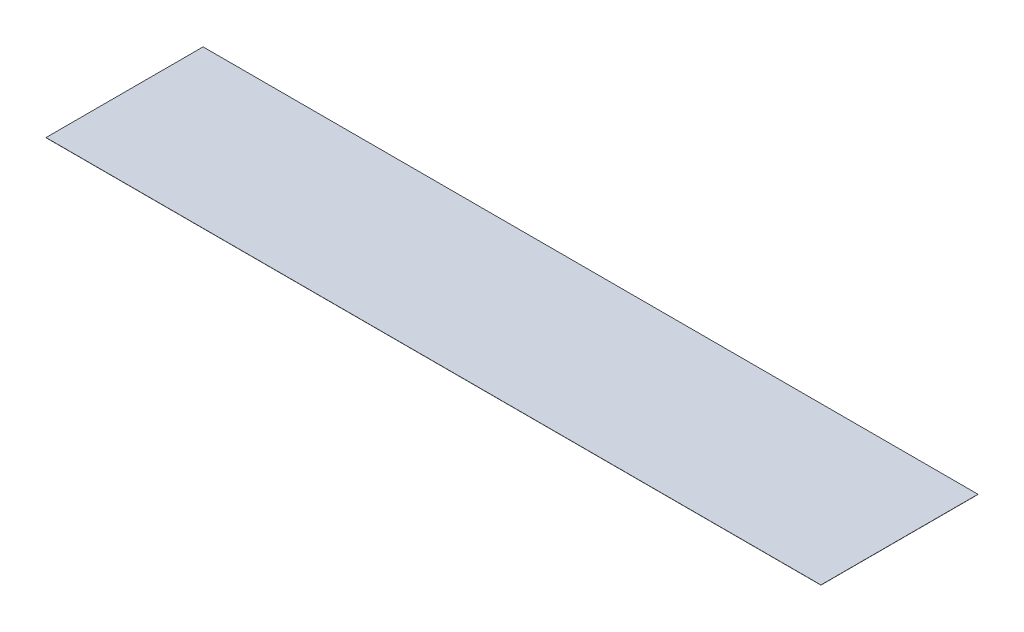
ISO-10303-21;
HEADER;
FILE_DESCRIPTION(('STEP AP214'),'2;1');
FILE_NAME('part.step','',(''),(''),'','','');
FILE_SCHEMA(('AUTOMOTIVE_DESIGN { 1 0 10303 214 1 1 1 1 }'));
ENDSEC;
DATA;
#1=APPLICATION_CONTEXT('core data for automotive mechanical design processes');
#2=APPLICATION_PROTOCOL_DEFINITION('international standard','automotive_design',2000,#1);
#3=PRODUCT_CONTEXT('',#1,'mechanical');
#4=PRODUCT('Part','Part','',(#3));
#5=PRODUCT_RELATED_PRODUCT_CATEGORY('part','',(#4));
#6=PRODUCT_DEFINITION_FORMATION('','',#4);
#7=PRODUCT_DEFINITION_CONTEXT('part definition',#1,'design');
#8=PRODUCT_DEFINITION('design','',#6,#7);
#9=PRODUCT_DEFINITION_SHAPE('','',#8);
#10=(LENGTH_UNIT() NAMED_UNIT(*) SI_UNIT(.MILLI.,.METRE.));
#11=(NAMED_UNIT(*) PLANE_ANGLE_UNIT() SI_UNIT($,.RADIAN.));
#12=(NAMED_UNIT(*) SI_UNIT($,.STERADIAN.) SOLID_ANGLE_UNIT());
#13=UNCERTAINTY_MEASURE_WITH_UNIT(LENGTH_MEASURE(1.E-05),#10,'distance_accuracy_value','');
#14=(GEOMETRIC_REPRESENTATION_CONTEXT(3) GLOBAL_UNCERTAINTY_ASSIGNED_CONTEXT((#13)) GLOBAL_UNIT_ASSIGNED_CONTEXT((#10,
#11,#12)) REPRESENTATION_CONTEXT('',''));
#15=CARTESIAN_POINT('',(0.,0.,0.));
#16=DIRECTION('',(0.,0.,1.));
#17=DIRECTION('',(1.,0.,0.));
#18=AXIS2_PLACEMENT_3D('',#15,#16,#17);
#19=CARTESIAN_POINT('',(0.,4.7752,0.));
#20=DIRECTION('',(1.,0.,0.));
#21=DIRECTION('',(0.,0.,-1.));
#22=AXIS2_PLACEMENT_3D('',#19,#20,#21);
#23=PLANE('',#22);
#24=DIRECTION('',(0.,0.,1.));
#25=VECTOR('',#24,1.);
#26=CARTESIAN_POINT('',(0.,0.,0.));
#27=LINE('',#26,#25);
#28=CARTESIAN_POINT('',(0.,-2.03000116716368E-12,-4572.));
#29=VERTEX_POINT('',#28);
#30=CARTESIAN_POINT('',(0.,0.,0.));
#31=VERTEX_POINT('',#30);
#32=EDGE_CURVE('E93',#29,#31,#27,.T.);
#33=ORIENTED_EDGE('',*,*,#32,.T.);
#34=DIRECTION('',(0.,-1.,0.));
#35=VECTOR('',#34,1.);
#36=CARTESIAN_POINT('',(0.,4.7752,0.));
#37=LINE('',#36,#35);
#38=CARTESIAN_POINT('',(0.,4.7752,0.));
#39=VERTEX_POINT('',#38);
#40=EDGE_CURVE('E11',#39,#31,#37,.T.);
#41=ORIENTED_EDGE('',*,*,#40,.F.);
#42=DIRECTION('',(0.,0.,1.));
#43=VECTOR('',#42,1.);
#44=CARTESIAN_POINT('',(0.,4.7752,0.));
#45=LINE('',#44,#43);
#46=CARTESIAN_POINT('',(0.,4.77519999999797,-4572.));
#47=VERTEX_POINT('',#46);
#48=EDGE_CURVE('E81',#47,#39,#45,.T.);
#49=ORIENTED_EDGE('',*,*,#48,.F.);
#50=DIRECTION('',(0.,-1.,0.));
#51=VECTOR('',#50,1.);
#52=CARTESIAN_POINT('',(0.,4.77519999999797,-4572.));
#53=LINE('',#52,#51);
#54=EDGE_CURVE('E89',#47,#29,#53,.T.);
#55=ORIENTED_EDGE('',*,*,#54,.T.);
#56=EDGE_LOOP('',(#33,#41,#49,#55));
#57=FACE_BOUND('',#56,.T.);
#58=ADVANCED_FACE('F30',(#57),#23,.F.);
#59=CARTESIAN_POINT('',(0.,4.7752,0.));
#60=DIRECTION('',(0.,0.,-1.));
#61=DIRECTION('',(-1.,0.,0.));
#62=AXIS2_PLACEMENT_3D('',#59,#60,#61);
#63=PLANE('',#62);
#64=DIRECTION('',(1.,0.,0.));
#65=VECTOR('',#64,1.);
#66=CARTESIAN_POINT('',(0.,0.,0.));
#67=LINE('',#66,#65);
#68=CARTESIAN_POINT('',(22555.2,0.,0.));
#69=VERTEX_POINT('',#68);
#70=EDGE_CURVE('E85',#31,#69,#67,.T.);
#71=ORIENTED_EDGE('',*,*,#70,.T.);
#72=DIRECTION('',(0.,-1.,0.));
#73=VECTOR('',#72,1.);
#74=CARTESIAN_POINT('',(22555.2,4.7752,0.));
#75=LINE('',#74,#73);
#76=CARTESIAN_POINT('',(22555.2,4.7752,0.));
#77=VERTEX_POINT('',#76);
#78=EDGE_CURVE('E38',#77,#69,#75,.T.);
#79=ORIENTED_EDGE('',*,*,#78,.F.);
#80=DIRECTION('',(1.,0.,0.));
#81=VECTOR('',#80,1.);
#82=CARTESIAN_POINT('',(0.,4.7752,0.));
#83=LINE('',#82,#81);
#84=EDGE_CURVE('E76',#39,#77,#83,.T.);
#85=ORIENTED_EDGE('',*,*,#84,.F.);
#86=ORIENTED_EDGE('',*,*,#40,.T.);
#87=EDGE_LOOP('',(#71,#79,#85,#86));
#88=FACE_BOUND('',#87,.T.);
#89=ADVANCED_FACE('F84',(#88),#63,.F.);
#90=CARTESIAN_POINT('',(22555.2,4.7752,0.));
#91=DIRECTION('',(-1.,0.,0.));
#92=DIRECTION('',(0.,0.,1.));
#93=AXIS2_PLACEMENT_3D('',#90,#91,#92);
#94=PLANE('',#93);
#95=DIRECTION('',(0.,0.,-1.));
#96=VECTOR('',#95,1.);
#97=CARTESIAN_POINT('',(22555.2,0.,0.));
#98=LINE('',#97,#96);
#99=CARTESIAN_POINT('',(22555.2,-2.03000116716368E-12,-4572.));
#100=VERTEX_POINT('',#99);
#101=EDGE_CURVE('E63',#69,#100,#98,.T.);
#102=ORIENTED_EDGE('',*,*,#101,.T.);
#103=DIRECTION('',(0.,-1.,0.));
#104=VECTOR('',#103,1.);
#105=CARTESIAN_POINT('',(22555.2,4.77519999999797,-4572.));
#106=LINE('',#105,#104);
#107=CARTESIAN_POINT('',(22555.2,4.77519999999797,-4572.));
#108=VERTEX_POINT('',#107);
#109=EDGE_CURVE('E86',#108,#100,#106,.T.);
#110=ORIENTED_EDGE('',*,*,#109,.F.);
#111=DIRECTION('',(0.,0.,-1.));
#112=VECTOR('',#111,1.);
#113=CARTESIAN_POINT('',(22555.2,4.7752,0.));
#114=LINE('',#113,#112);
#115=EDGE_CURVE('E79',#77,#108,#114,.T.);
#116=ORIENTED_EDGE('',*,*,#115,.F.);
#117=ORIENTED_EDGE('',*,*,#78,.T.);
#118=EDGE_LOOP('',(#102,#110,#116,#117));
#119=FACE_BOUND('',#118,.T.);
#120=ADVANCED_FACE('F87',(#119),#94,.F.);
#121=CARTESIAN_POINT('',(0.,4.77519999999797,-4572.));
#122=DIRECTION('',(0.,0.,1.));
#123=DIRECTION('',(1.,0.,0.));
#124=AXIS2_PLACEMENT_3D('',#121,#122,#123);
#125=PLANE('',#124);
#126=DIRECTION('',(-1.,0.,0.));
#127=VECTOR('',#126,1.);
#128=CARTESIAN_POINT('',(0.,-2.03000116716368E-12,-4572.));
#129=LINE('',#128,#127);
#130=EDGE_CURVE('E69',#100,#29,#129,.T.);
#131=ORIENTED_EDGE('',*,*,#130,.T.);
#132=ORIENTED_EDGE('',*,*,#54,.F.);
#133=DIRECTION('',(-1.,0.,0.));
#134=VECTOR('',#133,1.);
#135=CARTESIAN_POINT('',(0.,4.77519999999797,-4572.));
#136=LINE('',#135,#134);
#137=EDGE_CURVE('E46',#108,#47,#136,.T.);
#138=ORIENTED_EDGE('',*,*,#137,.F.);
#139=ORIENTED_EDGE('',*,*,#109,.T.);
#140=EDGE_LOOP('',(#131,#132,#138,#139));
#141=FACE_BOUND('',#140,.T.);
#142=ADVANCED_FACE('F100',(#141),#125,.F.);
#143=CARTESIAN_POINT('',(0.,4.7752,0.));
#144=DIRECTION('',(0.,-1.,0.));
#145=DIRECTION('',(0.,0.,-1.));
#146=AXIS2_PLACEMENT_3D('',#143,#144,#145);
#147=PLANE('',#146);
#148=ORIENTED_EDGE('',*,*,#48,.T.);
#149=ORIENTED_EDGE('',*,*,#84,.T.);
#150=ORIENTED_EDGE('',*,*,#115,.T.);
#151=ORIENTED_EDGE('',*,*,#137,.T.);
#152=EDGE_LOOP('',(#148,#149,#150,#151));
#153=FACE_BOUND('',#152,.T.);
#154=ADVANCED_FACE('F77',(#153),#147,.F.);
#155=CARTESIAN_POINT('',(0.,0.,0.));
#156=DIRECTION('',(0.,-1.,0.));
#157=DIRECTION('',(0.,0.,-1.));
#158=AXIS2_PLACEMENT_3D('',#155,#156,#157);
#159=PLANE('',#158);
#160=ORIENTED_EDGE('',*,*,#32,.F.);
#161=ORIENTED_EDGE('',*,*,#130,.F.);
#162=ORIENTED_EDGE('',*,*,#101,.F.);
#163=ORIENTED_EDGE('',*,*,#70,.F.);
#164=EDGE_LOOP('',(#160,#161,#162,#163));
#165=FACE_BOUND('',#164,.T.);
#166=ADVANCED_FACE('F103',(#165),#159,.T.);
#167=CLOSED_SHELL('',(#58,#89,#120,#142,#154,#166));
#168=MANIFOLD_SOLID_BREP('B2',#167);
#169=ADVANCED_BREP_SHAPE_REPRESENTATION('',(#18,#168),#14);
#170=SHAPE_DEFINITION_REPRESENTATION(#9,#169);
ENDSEC;
END-ISO-10303-21;
